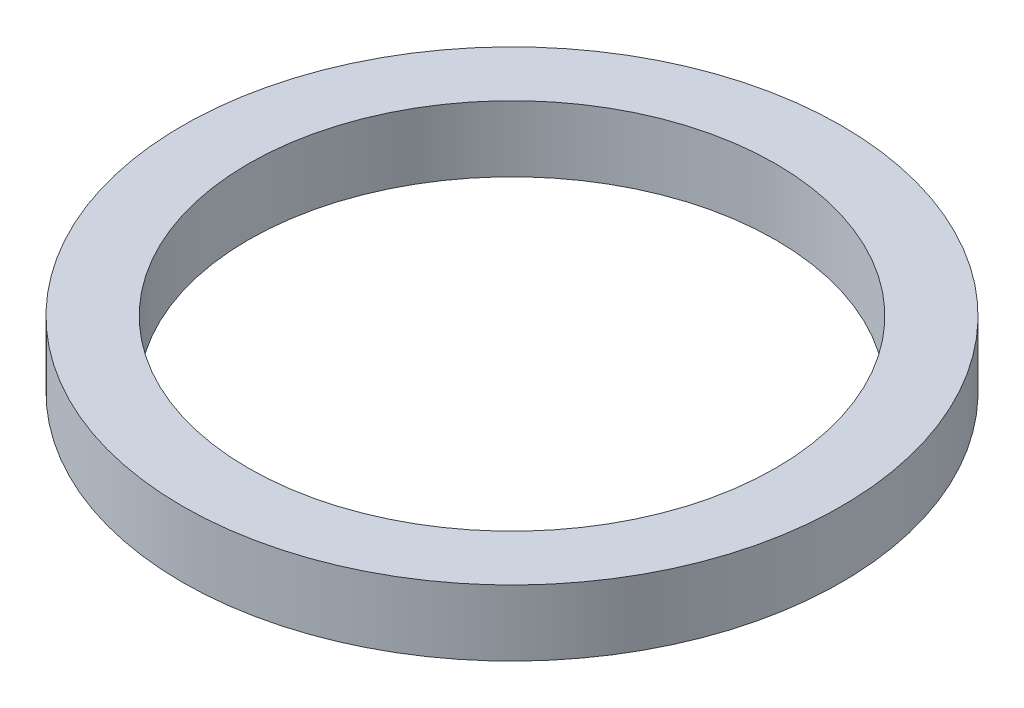
ISO-10303-21;
HEADER;
FILE_DESCRIPTION(('STEP AP214'),'2;1');
FILE_NAME('part.step','',(''),(''),'','','');
FILE_SCHEMA(('AUTOMOTIVE_DESIGN { 1 0 10303 214 1 1 1 1 }'));
ENDSEC;
DATA;
#1=APPLICATION_CONTEXT('core data for automotive mechanical design processes');
#2=APPLICATION_PROTOCOL_DEFINITION('international standard','automotive_design',2000,#1);
#3=PRODUCT_CONTEXT('',#1,'mechanical');
#4=PRODUCT('Part','Part','',(#3));
#5=PRODUCT_RELATED_PRODUCT_CATEGORY('part','',(#4));
#6=PRODUCT_DEFINITION_FORMATION('','',#4);
#7=PRODUCT_DEFINITION_CONTEXT('part definition',#1,'design');
#8=PRODUCT_DEFINITION('design','',#6,#7);
#9=PRODUCT_DEFINITION_SHAPE('','',#8);
#10=(LENGTH_UNIT() NAMED_UNIT(*) SI_UNIT(.MILLI.,.METRE.));
#11=(NAMED_UNIT(*) PLANE_ANGLE_UNIT() SI_UNIT($,.RADIAN.));
#12=(NAMED_UNIT(*) SI_UNIT($,.STERADIAN.) SOLID_ANGLE_UNIT());
#13=UNCERTAINTY_MEASURE_WITH_UNIT(LENGTH_MEASURE(1.E-05),#10,'distance_accuracy_value','');
#14=(GEOMETRIC_REPRESENTATION_CONTEXT(3) GLOBAL_UNCERTAINTY_ASSIGNED_CONTEXT((#13)) GLOBAL_UNIT_ASSIGNED_CONTEXT((#10,
#11,#12)) REPRESENTATION_CONTEXT('',''));
#15=CARTESIAN_POINT('',(0.,0.,0.));
#16=DIRECTION('',(0.,0.,1.));
#17=DIRECTION('',(1.,0.,0.));
#18=AXIS2_PLACEMENT_3D('',#15,#16,#17);
#19=CARTESIAN_POINT('',(0.,10.,0.));
#20=DIRECTION('',(0.,-1.,0.));
#21=DIRECTION('',(0.,0.,-1.));
#22=AXIS2_PLACEMENT_3D('',#19,#20,#21);
#23=CYLINDRICAL_SURFACE('',#22,50.);
#24=CARTESIAN_POINT('',(0.,10.,0.));
#25=DIRECTION('',(0.,1.,0.));
#26=DIRECTION('',(0.,0.,1.));
#27=AXIS2_PLACEMENT_3D('',#24,#25,#26);
#28=CIRCLE('',#27,50.);
#29=CARTESIAN_POINT('',(0.,10.,50.));
#30=VERTEX_POINT('',#29);
#31=EDGE_CURVE('E10',#30,#30,#28,.T.);
#32=ORIENTED_EDGE('',*,*,#31,.F.);
#33=EDGE_LOOP('',(#32));
#34=FACE_BOUND('',#33,.T.);
#35=CARTESIAN_POINT('',(0.,0.,0.));
#36=DIRECTION('',(0.,1.,0.));
#37=DIRECTION('',(0.,0.,1.));
#38=AXIS2_PLACEMENT_3D('',#35,#36,#37);
#39=CIRCLE('',#38,50.);
#40=CARTESIAN_POINT('',(0.,0.,50.));
#41=VERTEX_POINT('',#40);
#42=EDGE_CURVE('E45',#41,#41,#39,.T.);
#43=ORIENTED_EDGE('',*,*,#42,.T.);
#44=EDGE_LOOP('',(#43));
#45=FACE_BOUND('',#44,.T.);
#46=ADVANCED_FACE('F37',(#34,#45),#23,.T.);
#47=CARTESIAN_POINT('',(0.,10.,0.));
#48=DIRECTION('',(0.,1.,0.));
#49=DIRECTION('',(0.,0.,1.));
#50=AXIS2_PLACEMENT_3D('',#47,#48,#49);
#51=PLANE('',#50);
#52=CARTESIAN_POINT('',(0.,10.,0.));
#53=DIRECTION('',(0.,1.,0.));
#54=DIRECTION('',(0.,0.,1.));
#55=AXIS2_PLACEMENT_3D('',#52,#53,#54);
#56=CIRCLE('',#55,40.);
#57=CARTESIAN_POINT('',(0.,10.,40.));
#58=VERTEX_POINT('',#57);
#59=EDGE_CURVE('E52',#58,#58,#56,.T.);
#60=ORIENTED_EDGE('',*,*,#59,.F.);
#61=EDGE_LOOP('',(#60));
#62=FACE_BOUND('',#61,.T.);
#63=ORIENTED_EDGE('',*,*,#31,.T.);
#64=EDGE_LOOP('',(#63));
#65=FACE_BOUND('',#64,.T.);
#66=ADVANCED_FACE('F70',(#62,#65),#51,.T.);
#67=CARTESIAN_POINT('',(0.,0.,0.));
#68=DIRECTION('',(0.,1.,0.));
#69=DIRECTION('',(0.,0.,1.));
#70=AXIS2_PLACEMENT_3D('',#67,#68,#69);
#71=PLANE('',#70);
#72=CARTESIAN_POINT('',(0.,0.,0.));
#73=DIRECTION('',(0.,1.,0.));
#74=DIRECTION('',(0.,0.,1.));
#75=AXIS2_PLACEMENT_3D('',#72,#73,#74);
#76=CIRCLE('',#75,40.);
#77=CARTESIAN_POINT('',(0.,0.,40.));
#78=VERTEX_POINT('',#77);
#79=EDGE_CURVE('E40',#78,#78,#76,.T.);
#80=ORIENTED_EDGE('',*,*,#79,.T.);
#81=EDGE_LOOP('',(#80));
#82=FACE_BOUND('',#81,.T.);
#83=ORIENTED_EDGE('',*,*,#42,.F.);
#84=EDGE_LOOP('',(#83));
#85=FACE_BOUND('',#84,.T.);
#86=ADVANCED_FACE('F61',(#82,#85),#71,.F.);
#87=CARTESIAN_POINT('',(0.,-10.,0.));
#88=DIRECTION('',(0.,1.,0.));
#89=DIRECTION('',(0.,0.,1.));
#90=AXIS2_PLACEMENT_3D('',#87,#88,#89);
#91=CYLINDRICAL_SURFACE('',#90,40.);
#92=ORIENTED_EDGE('',*,*,#59,.T.);
#93=EDGE_LOOP('',(#92));
#94=FACE_BOUND('',#93,.T.);
#95=ORIENTED_EDGE('',*,*,#79,.F.);
#96=EDGE_LOOP('',(#95));
#97=FACE_BOUND('',#96,.T.);
#98=ADVANCED_FACE('F64',(#94,#97),#91,.F.);
#99=CLOSED_SHELL('',(#46,#66,#86,#98));
#100=MANIFOLD_SOLID_BREP('B2',#99);
#101=ADVANCED_BREP_SHAPE_REPRESENTATION('',(#18,#100),#14);
#102=SHAPE_DEFINITION_REPRESENTATION(#9,#101);
ENDSEC;
END-ISO-10303-21;
